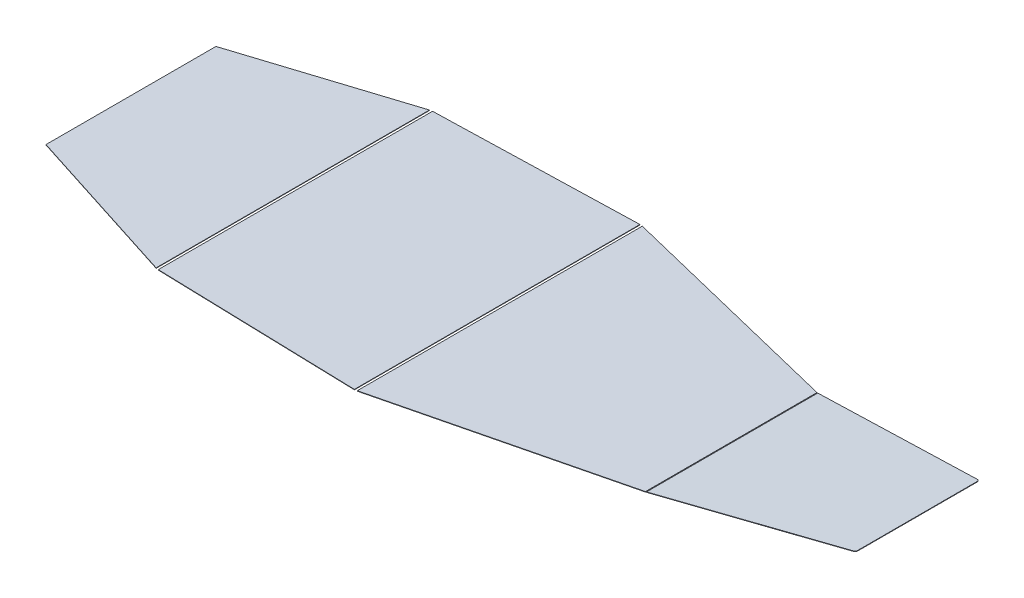
ISO-10303-21;
HEADER;
FILE_DESCRIPTION(('STEP AP214'),'2;1');
FILE_NAME('part.step','',(''),(''),'','','');
FILE_SCHEMA(('AUTOMOTIVE_DESIGN { 1 0 10303 214 1 1 1 1 }'));
ENDSEC;
DATA;
#1=APPLICATION_CONTEXT('core data for automotive mechanical design processes');
#2=APPLICATION_PROTOCOL_DEFINITION('international standard','automotive_design',2000,#1);
#3=PRODUCT_CONTEXT('',#1,'mechanical');
#4=PRODUCT('Part','Part','',(#3));
#5=PRODUCT_RELATED_PRODUCT_CATEGORY('part','',(#4));
#6=PRODUCT_DEFINITION_FORMATION('','',#4);
#7=PRODUCT_DEFINITION_CONTEXT('part definition',#1,'design');
#8=PRODUCT_DEFINITION('design','',#6,#7);
#9=PRODUCT_DEFINITION_SHAPE('','',#8);
#10=(LENGTH_UNIT() NAMED_UNIT(*) SI_UNIT(.MILLI.,.METRE.));
#11=(NAMED_UNIT(*) PLANE_ANGLE_UNIT() SI_UNIT($,.RADIAN.));
#12=(NAMED_UNIT(*) SI_UNIT($,.STERADIAN.) SOLID_ANGLE_UNIT());
#13=UNCERTAINTY_MEASURE_WITH_UNIT(LENGTH_MEASURE(1.E-05),#10,'distance_accuracy_value','');
#14=(GEOMETRIC_REPRESENTATION_CONTEXT(3) GLOBAL_UNCERTAINTY_ASSIGNED_CONTEXT((#13)) GLOBAL_UNIT_ASSIGNED_CONTEXT((#10,
#11,#12)) REPRESENTATION_CONTEXT('',''));
#15=CARTESIAN_POINT('',(0.,0.,0.));
#16=DIRECTION('',(0.,0.,1.));
#17=DIRECTION('',(1.,0.,0.));
#18=AXIS2_PLACEMENT_3D('',#15,#16,#17);
#19=CARTESIAN_POINT('',(2505.5741089449,126.22185605982,136.375901149343));
#20=DIRECTION('',(0.154776003065256,-0.987949588225606,0.));
#21=DIRECTION('',(0.987949588225606,0.154776003065257,0.));
#22=AXIS2_PLACEMENT_3D('',#19,#20,#21);
#23=CYLINDRICAL_SURFACE('',#22,5.99999999999981);
#24=CARTESIAN_POINT('',(2505.72888494797,125.233906471594,136.375901149343));
#25=DIRECTION('',(0.154776003065257,-0.987949588225606,0.));
#26=DIRECTION('',(0.987949588225606,0.154776003065257,0.));
#27=AXIS2_PLACEMENT_3D('',#24,#25,#26);
#28=CIRCLE('',#27,5.99999999999981);
#29=CARTESIAN_POINT('',(2511.65658247732,126.162562489986,136.375901149343));
#30=VERTEX_POINT('',#29);
#31=CARTESIAN_POINT('',(2506.47749497052,125.351186612734,142.327861196472));
#32=VERTEX_POINT('',#31);
#33=EDGE_CURVE('E130',#30,#32,#28,.T.);
#34=ORIENTED_EDGE('',*,*,#33,.F.);
#35=DIRECTION('',(0.154776003065256,-0.987949588225606,0.));
#36=VECTOR('',#35,1.);
#37=CARTESIAN_POINT('',(2511.50180647425,127.150512078212,136.375901149343));
#38=LINE('',#37,#36);
#39=CARTESIAN_POINT('',(2511.50180647425,127.150512078212,136.375901149343));
#40=VERTEX_POINT('',#39);
#41=EDGE_CURVE('E12',#40,#30,#38,.T.);
#42=ORIENTED_EDGE('',*,*,#41,.F.);
#43=CARTESIAN_POINT('',(2505.5741089449,126.22185605982,136.375901149343));
#44=DIRECTION('',(0.154776003065257,-0.987949588225606,0.));
#45=DIRECTION('',(0.987949588225606,0.154776003065257,0.));
#46=AXIS2_PLACEMENT_3D('',#43,#44,#45);
#47=CIRCLE('',#46,5.99999999999981);
#48=CARTESIAN_POINT('',(2506.32271896746,126.33913620096,142.327861196472));
#49=VERTEX_POINT('',#48);
#50=EDGE_CURVE('E142',#40,#49,#47,.T.);
#51=ORIENTED_EDGE('',*,*,#50,.T.);
#52=DIRECTION('',(0.154776003065256,-0.987949588225606,0.));
#53=VECTOR('',#52,1.);
#54=CARTESIAN_POINT('',(2506.32271896746,126.33913620096,142.327861196472));
#55=LINE('',#54,#53);
#56=EDGE_CURVE('E48',#49,#32,#55,.T.);
#57=ORIENTED_EDGE('',*,*,#56,.T.);
#58=EDGE_LOOP('',(#34,#42,#51,#57));
#59=FACE_BOUND('',#58,.T.);
#60=ADVANCED_FACE('F45',(#59),#23,.T.);
#61=CARTESIAN_POINT('',(2511.50180647425,127.150512078212,136.375901149343));
#62=DIRECTION('',(0.987949588225606,0.154776003065257,0.));
#63=DIRECTION('',(-0.154776003065257,0.987949588225606,0.));
#64=AXIS2_PLACEMENT_3D('',#61,#62,#63);
#65=PLANE('',#64);
#66=DIRECTION('',(0.,0.,1.));
#67=VECTOR('',#66,1.);
#68=CARTESIAN_POINT('',(2511.65658247732,126.162562489986,136.375901149343));
#69=LINE('',#68,#67);
#70=CARTESIAN_POINT('',(2511.65658247732,126.162562489986,-136.375901149342));
#71=VERTEX_POINT('',#70);
#72=EDGE_CURVE('E82',#71,#30,#69,.T.);
#73=ORIENTED_EDGE('',*,*,#72,.F.);
#74=DIRECTION('',(0.154776003065256,-0.987949588225606,0.));
#75=VECTOR('',#74,1.);
#76=CARTESIAN_POINT('',(2511.50180647425,127.150512078211,-136.375901149342));
#77=LINE('',#76,#75);
#78=CARTESIAN_POINT('',(2511.50180647425,127.150512078211,-136.375901149342));
#79=VERTEX_POINT('',#78);
#80=EDGE_CURVE('E54',#79,#71,#77,.T.);
#81=ORIENTED_EDGE('',*,*,#80,.F.);
#82=DIRECTION('',(0.,0.,1.));
#83=VECTOR('',#82,1.);
#84=CARTESIAN_POINT('',(2511.50180647425,127.150512078211,-136.375901149342));
#85=LINE('',#84,#83);
#86=EDGE_CURVE('E62',#79,#40,#85,.T.);
#87=ORIENTED_EDGE('',*,*,#86,.T.);
#88=ORIENTED_EDGE('',*,*,#41,.T.);
#89=EDGE_LOOP('',(#73,#81,#87,#88));
#90=FACE_BOUND('',#89,.T.);
#91=ADVANCED_FACE('F163',(#90),#65,.T.);
#92=CARTESIAN_POINT('',(2505.5741089449,126.22185605982,-136.375901149342));
#93=DIRECTION('',(0.154776003065256,-0.987949588225606,0.));
#94=DIRECTION('',(0.987949588225606,0.154776003065257,0.));
#95=AXIS2_PLACEMENT_3D('',#92,#93,#94);
#96=CYLINDRICAL_SURFACE('',#95,5.99999999999981);
#97=CARTESIAN_POINT('',(2505.72888494797,125.233906471594,-136.375901149342));
#98=DIRECTION('',(0.154776003065257,-0.987949588225606,0.));
#99=DIRECTION('',(-0.987949588225606,-0.154776003065257,0.));
#100=AXIS2_PLACEMENT_3D('',#97,#98,#99);
#101=CIRCLE('',#100,5.99999999999981);
#102=CARTESIAN_POINT('',(2506.47749497052,125.351186612734,-142.327861196472));
#103=VERTEX_POINT('',#102);
#104=EDGE_CURVE('E107',#103,#71,#101,.T.);
#105=ORIENTED_EDGE('',*,*,#104,.F.);
#106=DIRECTION('',(0.154776003065256,-0.987949588225606,0.));
#107=VECTOR('',#106,1.);
#108=CARTESIAN_POINT('',(2506.32271896746,126.339136200959,-142.327861196472));
#109=LINE('',#108,#107);
#110=CARTESIAN_POINT('',(2506.32271896746,126.339136200959,-142.327861196472));
#111=VERTEX_POINT('',#110);
#112=EDGE_CURVE('E102',#111,#103,#109,.T.);
#113=ORIENTED_EDGE('',*,*,#112,.F.);
#114=CARTESIAN_POINT('',(2505.5741089449,126.22185605982,-136.375901149342));
#115=DIRECTION('',(0.154776003065257,-0.987949588225606,0.));
#116=DIRECTION('',(-0.987949588225606,-0.154776003065257,0.));
#117=AXIS2_PLACEMENT_3D('',#114,#115,#116);
#118=CIRCLE('',#117,5.99999999999981);
#119=EDGE_CURVE('E105',#111,#79,#118,.T.);
#120=ORIENTED_EDGE('',*,*,#119,.T.);
#121=ORIENTED_EDGE('',*,*,#80,.T.);
#122=EDGE_LOOP('',(#105,#113,#120,#121));
#123=FACE_BOUND('',#122,.T.);
#124=ADVANCED_FACE('F104',(#123),#96,.T.);
#125=CARTESIAN_POINT('',(2086.12874483775,60.5099232502177,-196.475045869278));
#126=DIRECTION('',(0.124768337092657,0.0195466901899149,-0.991993341188212));
#127=DIRECTION('',(-0.992182902493873,0.,-0.124792179237461));
#128=AXIS2_PLACEMENT_3D('',#125,#126,#127);
#129=PLANE('',#128);
#130=DIRECTION('',(0.980039412949437,0.153536764416461,0.126290185835034));
#131=VECTOR('',#130,1.);
#132=CARTESIAN_POINT('',(2086.28352084082,59.5219736619921,-196.475045869278));
#133=LINE('',#132,#131);
#134=CARTESIAN_POINT('',(2086.28352084082,59.5219736619921,-196.475045869278));
#135=VERTEX_POINT('',#134);
#136=EDGE_CURVE('E139',#135,#103,#133,.T.);
#137=ORIENTED_EDGE('',*,*,#136,.F.);
#138=DIRECTION('',(0.154776003065256,-0.987949588225606,0.));
#139=VECTOR('',#138,1.);
#140=CARTESIAN_POINT('',(2086.12874483775,60.5099232502177,-196.475045869278));
#141=LINE('',#140,#139);
#142=CARTESIAN_POINT('',(2086.12874483775,60.5099232502177,-196.475045869278));
#143=VERTEX_POINT('',#142);
#144=EDGE_CURVE('E112',#143,#135,#141,.T.);
#145=ORIENTED_EDGE('',*,*,#144,.F.);
#146=DIRECTION('',(0.980039412949437,0.153536764416461,0.126290185835034));
#147=VECTOR('',#146,1.);
#148=CARTESIAN_POINT('',(2086.12874483775,60.5099232502177,-196.475045869278));
#149=LINE('',#148,#147);
#150=EDGE_CURVE('E119',#143,#111,#149,.T.);
#151=ORIENTED_EDGE('',*,*,#150,.T.);
#152=ORIENTED_EDGE('',*,*,#112,.T.);
#153=EDGE_LOOP('',(#137,#145,#151,#152));
#154=FACE_BOUND('',#153,.T.);
#155=ADVANCED_FACE('F122',(#154),#129,.T.);
#156=CARTESIAN_POINT('',(2086.12874483775,60.5099232502178,196.475045869278));
#157=DIRECTION('',(-0.987949588225606,-0.154776003065256,0.));
#158=DIRECTION('',(0.154776003065257,-0.987949588225606,0.));
#159=AXIS2_PLACEMENT_3D('',#156,#157,#158);
#160=PLANE('',#159);
#161=DIRECTION('',(0.,0.,-1.));
#162=VECTOR('',#161,1.);
#163=CARTESIAN_POINT('',(2086.28352084082,59.5219736619922,196.475045869278));
#164=LINE('',#163,#162);
#165=CARTESIAN_POINT('',(2086.28352084082,59.5219736619922,196.475045869278));
#166=VERTEX_POINT('',#165);
#167=EDGE_CURVE('E136',#166,#135,#164,.T.);
#168=ORIENTED_EDGE('',*,*,#167,.F.);
#169=DIRECTION('',(0.154776003065256,-0.987949588225606,0.));
#170=VECTOR('',#169,1.);
#171=CARTESIAN_POINT('',(2086.12874483775,60.5099232502178,196.475045869278));
#172=LINE('',#171,#170);
#173=CARTESIAN_POINT('',(2086.12874483775,60.5099232502178,196.475045869278));
#174=VERTEX_POINT('',#173);
#175=EDGE_CURVE('E145',#174,#166,#172,.T.);
#176=ORIENTED_EDGE('',*,*,#175,.F.);
#177=DIRECTION('',(0.,0.,-1.));
#178=VECTOR('',#177,1.);
#179=CARTESIAN_POINT('',(2086.12874483775,60.5099232502178,196.475045869278));
#180=LINE('',#179,#178);
#181=EDGE_CURVE('E123',#174,#143,#180,.T.);
#182=ORIENTED_EDGE('',*,*,#181,.T.);
#183=ORIENTED_EDGE('',*,*,#144,.T.);
#184=EDGE_LOOP('',(#168,#176,#182,#183));
#185=FACE_BOUND('',#184,.T.);
#186=ADVANCED_FACE('F153',(#185),#160,.T.);
#187=CARTESIAN_POINT('',(2086.12874483775,60.5099232502178,196.475045869278));
#188=DIRECTION('',(0.124768337092657,0.0195466901899152,0.991993341188212));
#189=DIRECTION('',(0.992182902493873,0.,-0.12479217923746));
#190=AXIS2_PLACEMENT_3D('',#187,#188,#189);
#191=PLANE('',#190);
#192=DIRECTION('',(-0.980039412949437,-0.153536764416461,0.126290185835034));
#193=VECTOR('',#192,1.);
#194=CARTESIAN_POINT('',(2086.28352084082,59.5219736619922,196.475045869278));
#195=LINE('',#194,#193);
#196=EDGE_CURVE('E133',#32,#166,#195,.T.);
#197=ORIENTED_EDGE('',*,*,#196,.F.);
#198=ORIENTED_EDGE('',*,*,#56,.F.);
#199=DIRECTION('',(-0.980039412949437,-0.153536764416461,0.126290185835034));
#200=VECTOR('',#199,1.);
#201=CARTESIAN_POINT('',(2086.12874483775,60.5099232502178,196.475045869278));
#202=LINE('',#201,#200);
#203=EDGE_CURVE('E125',#49,#174,#202,.T.);
#204=ORIENTED_EDGE('',*,*,#203,.T.);
#205=ORIENTED_EDGE('',*,*,#175,.T.);
#206=EDGE_LOOP('',(#197,#198,#204,#205));
#207=FACE_BOUND('',#206,.T.);
#208=ADVANCED_FACE('F149',(#207),#191,.T.);
#209=CARTESIAN_POINT('',(2505.5741089449,126.22185605982,136.375901149343));
#210=DIRECTION('',(0.154776003065257,-0.987949588225606,0.));
#211=DIRECTION('',(0.987949588225606,0.154776003065257,0.));
#212=AXIS2_PLACEMENT_3D('',#209,#210,#211);
#213=PLANE('',#212);
#214=ORIENTED_EDGE('',*,*,#50,.F.);
#215=ORIENTED_EDGE('',*,*,#86,.F.);
#216=ORIENTED_EDGE('',*,*,#119,.F.);
#217=ORIENTED_EDGE('',*,*,#150,.F.);
#218=ORIENTED_EDGE('',*,*,#181,.F.);
#219=ORIENTED_EDGE('',*,*,#203,.F.);
#220=EDGE_LOOP('',(#214,#215,#216,#217,#218,#219));
#221=FACE_BOUND('',#220,.T.);
#222=ADVANCED_FACE('F117',(#221),#213,.F.);
#223=CARTESIAN_POINT('',(2505.72888494797,125.233906471594,136.375901149343));
#224=DIRECTION('',(0.154776003065257,-0.987949588225606,0.));
#225=DIRECTION('',(0.987949588225606,0.154776003065257,0.));
#226=AXIS2_PLACEMENT_3D('',#223,#224,#225);
#227=PLANE('',#226);
#228=ORIENTED_EDGE('',*,*,#33,.T.);
#229=ORIENTED_EDGE('',*,*,#196,.T.);
#230=ORIENTED_EDGE('',*,*,#167,.T.);
#231=ORIENTED_EDGE('',*,*,#136,.T.);
#232=ORIENTED_EDGE('',*,*,#104,.T.);
#233=ORIENTED_EDGE('',*,*,#72,.T.);
#234=EDGE_LOOP('',(#228,#229,#230,#231,#232,#233));
#235=FACE_BOUND('',#234,.T.);
#236=ADVANCED_FACE('F151',(#235),#227,.T.);
#237=CLOSED_SHELL('',(#60,#91,#124,#155,#186,#208,#222,#236));
#238=MANIFOLD_SOLID_BREP('B2',#237);
#239=CARTESIAN_POINT('',(1083.5184979399,60.3,314.797366572685));
#240=DIRECTION('',(-0.0279961264300993,0.,0.999608031632855));
#241=DIRECTION('',(0.999608031632854,0.,0.0279961264300993));
#242=AXIS2_PLACEMENT_3D('',#239,#240,#241);
#243=PLANE('',#242);
#244=DIRECTION('',(-0.999608031632855,0.,-0.0279961264300993));
#245=VECTOR('',#244,1.);
#246=CARTESIAN_POINT('',(1083.5184979399,59.3,314.797366572685));
#247=LINE('',#246,#245);
#248=CARTESIAN_POINT('',(1546.67909351847,59.3,327.769153694159));
#249=VERTEX_POINT('',#248);
#250=CARTESIAN_POINT('',(1083.5184979399,59.3,314.797366572685));
#251=VERTEX_POINT('',#250);
#252=EDGE_CURVE('E300',#249,#251,#247,.T.);
#253=ORIENTED_EDGE('',*,*,#252,.F.);
#254=DIRECTION('',(0.,-1.,0.));
#255=VECTOR('',#254,1.);
#256=CARTESIAN_POINT('',(1546.67909351847,60.3,327.769153694159));
#257=LINE('',#256,#255);
#258=CARTESIAN_POINT('',(1546.67909351847,60.3,327.769153694159));
#259=VERTEX_POINT('',#258);
#260=EDGE_CURVE('E43',#259,#249,#257,.T.);
#261=ORIENTED_EDGE('',*,*,#260,.F.);
#262=DIRECTION('',(-0.999608031632855,0.,-0.0279961264300993));
#263=VECTOR('',#262,1.);
#264=CARTESIAN_POINT('',(1083.5184979399,60.3,314.797366572685));
#265=LINE('',#264,#263);
#266=CARTESIAN_POINT('',(1083.5184979399,60.3,314.797366572685));
#267=VERTEX_POINT('',#266);
#268=EDGE_CURVE('E294',#259,#267,#265,.T.);
#269=ORIENTED_EDGE('',*,*,#268,.T.);
#270=DIRECTION('',(0.,-1.,0.));
#271=VECTOR('',#270,1.);
#272=CARTESIAN_POINT('',(1083.5184979399,60.3,314.797366572685));
#273=LINE('',#272,#271);
#274=EDGE_CURVE('E239',#267,#251,#273,.T.);
#275=ORIENTED_EDGE('',*,*,#274,.T.);
#276=EDGE_LOOP('',(#253,#261,#269,#275));
#277=FACE_BOUND('',#276,.T.);
#278=ADVANCED_FACE('F236',(#277),#243,.T.);
#279=CARTESIAN_POINT('',(1546.67909351847,60.3,327.769153694159));
#280=DIRECTION('',(1.,0.,0.));
#281=DIRECTION('',(0.,0.,-1.));
#282=AXIS2_PLACEMENT_3D('',#279,#280,#281);
#283=PLANE('',#282);
#284=DIRECTION('',(0.,0.,1.));
#285=VECTOR('',#284,1.);
#286=CARTESIAN_POINT('',(1546.67909351847,59.3,327.769153694159));
#287=LINE('',#286,#285);
#288=CARTESIAN_POINT('',(1546.67909351847,59.3,-327.769153695261));
#289=VERTEX_POINT('',#288);
#290=EDGE_CURVE('E296',#289,#249,#287,.T.);
#291=ORIENTED_EDGE('',*,*,#290,.F.);
#292=DIRECTION('',(0.,-1.,0.));
#293=VECTOR('',#292,1.);
#294=CARTESIAN_POINT('',(1546.67909351847,60.3,-327.769153695261));
#295=LINE('',#294,#293);
#296=CARTESIAN_POINT('',(1546.67909351847,60.3,-327.769153695261));
#297=VERTEX_POINT('',#296);
#298=EDGE_CURVE('E245',#297,#289,#295,.T.);
#299=ORIENTED_EDGE('',*,*,#298,.F.);
#300=DIRECTION('',(0.,0.,1.));
#301=VECTOR('',#300,1.);
#302=CARTESIAN_POINT('',(1546.67909351847,60.3,327.769153694159));
#303=LINE('',#302,#301);
#304=EDGE_CURVE('E291',#297,#259,#303,.T.);
#305=ORIENTED_EDGE('',*,*,#304,.T.);
#306=ORIENTED_EDGE('',*,*,#260,.T.);
#307=EDGE_LOOP('',(#291,#299,#305,#306));
#308=FACE_BOUND('',#307,.T.);
#309=ADVANCED_FACE('F310',(#308),#283,.T.);
#310=CARTESIAN_POINT('',(1083.51849793991,60.3,-314.797366572692));
#311=DIRECTION('',(-0.0279961264324589,0.,-0.999608031632789));
#312=DIRECTION('',(-0.999608031632789,0.,0.0279961264324589));
#313=AXIS2_PLACEMENT_3D('',#310,#311,#312);
#314=PLANE('',#313);
#315=DIRECTION('',(0.999608031632788,0.,-0.0279961264324588));
#316=VECTOR('',#315,1.);
#317=CARTESIAN_POINT('',(1083.51849793991,59.3,-314.797366572692));
#318=LINE('',#317,#316);
#319=CARTESIAN_POINT('',(1083.51849793991,59.3,-314.797366572692));
#320=VERTEX_POINT('',#319);
#321=EDGE_CURVE('E286',#320,#289,#318,.T.);
#322=ORIENTED_EDGE('',*,*,#321,.F.);
#323=DIRECTION('',(0.,-1.,0.));
#324=VECTOR('',#323,1.);
#325=CARTESIAN_POINT('',(1083.51849793991,60.3,-314.797366572692));
#326=LINE('',#325,#324);
#327=CARTESIAN_POINT('',(1083.51849793991,60.3,-314.797366572692));
#328=VERTEX_POINT('',#327);
#329=EDGE_CURVE('E281',#328,#320,#326,.T.);
#330=ORIENTED_EDGE('',*,*,#329,.F.);
#331=DIRECTION('',(0.999608031632788,0.,-0.0279961264324588));
#332=VECTOR('',#331,1.);
#333=CARTESIAN_POINT('',(1083.51849793991,60.3,-314.797366572692));
#334=LINE('',#333,#332);
#335=EDGE_CURVE('E284',#328,#297,#334,.T.);
#336=ORIENTED_EDGE('',*,*,#335,.T.);
#337=ORIENTED_EDGE('',*,*,#298,.T.);
#338=EDGE_LOOP('',(#322,#330,#336,#337));
#339=FACE_BOUND('',#338,.T.);
#340=ADVANCED_FACE('F283',(#339),#314,.T.);
#341=CARTESIAN_POINT('',(1083.5184979399,60.3,314.797366572685));
#342=DIRECTION('',(-1.,0.,0.));
#343=DIRECTION('',(0.,0.,1.));
#344=AXIS2_PLACEMENT_3D('',#341,#342,#343);
#345=PLANE('',#344);
#346=DIRECTION('',(0.,0.,-1.));
#347=VECTOR('',#346,1.);
#348=CARTESIAN_POINT('',(1083.5184979399,59.3,314.797366572685));
#349=LINE('',#348,#347);
#350=EDGE_CURVE('E303',#251,#320,#349,.T.);
#351=ORIENTED_EDGE('',*,*,#350,.F.);
#352=ORIENTED_EDGE('',*,*,#274,.F.);
#353=DIRECTION('',(0.,0.,-1.));
#354=VECTOR('',#353,1.);
#355=CARTESIAN_POINT('',(1083.5184979399,60.3,314.797366572685));
#356=LINE('',#355,#354);
#357=EDGE_CURVE('E290',#267,#328,#356,.T.);
#358=ORIENTED_EDGE('',*,*,#357,.T.);
#359=ORIENTED_EDGE('',*,*,#329,.T.);
#360=EDGE_LOOP('',(#351,#352,#358,#359));
#361=FACE_BOUND('',#360,.T.);
#362=ADVANCED_FACE('F293',(#361),#345,.T.);
#363=CARTESIAN_POINT('',(0.,60.3,0.));
#364=DIRECTION('',(0.,1.,0.));
#365=DIRECTION('',(0.,0.,1.));
#366=AXIS2_PLACEMENT_3D('',#363,#364,#365);
#367=PLANE('',#366);
#368=ORIENTED_EDGE('',*,*,#268,.F.);
#369=ORIENTED_EDGE('',*,*,#304,.F.);
#370=ORIENTED_EDGE('',*,*,#335,.F.);
#371=ORIENTED_EDGE('',*,*,#357,.F.);
#372=EDGE_LOOP('',(#368,#369,#370,#371));
#373=FACE_BOUND('',#372,.T.);
#374=ADVANCED_FACE('F289',(#373),#367,.T.);
#375=CARTESIAN_POINT('',(0.,59.3,0.));
#376=DIRECTION('',(0.,1.,0.));
#377=DIRECTION('',(0.,0.,1.));
#378=AXIS2_PLACEMENT_3D('',#375,#376,#377);
#379=PLANE('',#378);
#380=ORIENTED_EDGE('',*,*,#252,.T.);
#381=ORIENTED_EDGE('',*,*,#350,.T.);
#382=ORIENTED_EDGE('',*,*,#321,.T.);
#383=ORIENTED_EDGE('',*,*,#290,.T.);
#384=EDGE_LOOP('',(#380,#381,#382,#383));
#385=FACE_BOUND('',#384,.T.);
#386=ADVANCED_FACE('F309',(#385),#379,.F.);
#387=CLOSED_SHELL('',(#278,#309,#340,#362,#374,#386));
#388=MANIFOLD_SOLID_BREP('B6',#387);
#389=CARTESIAN_POINT('',(706.,60.3,195.067870365376));
#390=DIRECTION('',(-0.304319977056343,0.,0.95256986702521));
#391=DIRECTION('',(0.95256986702521,0.,0.304319977056344));
#392=AXIS2_PLACEMENT_3D('',#389,#390,#391);
#393=PLANE('',#392);
#394=DIRECTION('',(-0.95256986702521,0.,-0.304319977056344));
#395=VECTOR('',#394,1.);
#396=CARTESIAN_POINT('',(706.,59.3,195.067870365376));
#397=LINE('',#396,#395);
#398=CARTESIAN_POINT('',(1077.51849793991,59.3,313.757852783313));
#399=VERTEX_POINT('',#398);
#400=CARTESIAN_POINT('',(706.,59.3,195.067870365376));
#401=VERTEX_POINT('',#400);
#402=EDGE_CURVE('E432',#399,#401,#397,.T.);
#403=ORIENTED_EDGE('',*,*,#402,.F.);
#404=DIRECTION('',(0.,-1.,0.));
#405=VECTOR('',#404,1.);
#406=CARTESIAN_POINT('',(1077.51849793991,60.3,313.757852783313));
#407=LINE('',#406,#405);
#408=CARTESIAN_POINT('',(1077.51849793991,60.3,313.757852783313));
#409=VERTEX_POINT('',#408);
#410=EDGE_CURVE('E234',#409,#399,#407,.T.);
#411=ORIENTED_EDGE('',*,*,#410,.F.);
#412=DIRECTION('',(-0.95256986702521,0.,-0.304319977056344));
#413=VECTOR('',#412,1.);
#414=CARTESIAN_POINT('',(706.,60.3,195.067870365376));
#415=LINE('',#414,#413);
#416=CARTESIAN_POINT('',(706.,60.3,195.067870365376));
#417=VERTEX_POINT('',#416);
#418=EDGE_CURVE('E426',#409,#417,#415,.T.);
#419=ORIENTED_EDGE('',*,*,#418,.T.);
#420=DIRECTION('',(0.,-1.,0.));
#421=VECTOR('',#420,1.);
#422=CARTESIAN_POINT('',(706.,60.3,195.067870365376));
#423=LINE('',#422,#421);
#424=EDGE_CURVE('E371',#417,#401,#423,.T.);
#425=ORIENTED_EDGE('',*,*,#424,.T.);
#426=EDGE_LOOP('',(#403,#411,#419,#425));
#427=FACE_BOUND('',#426,.T.);
#428=ADVANCED_FACE('F368',(#427),#393,.T.);
#429=CARTESIAN_POINT('',(1077.51849793991,60.3,313.757852783313));
#430=DIRECTION('',(1.,0.,0.));
#431=DIRECTION('',(0.,0.,-1.));
#432=AXIS2_PLACEMENT_3D('',#429,#430,#431);
#433=PLANE('',#432);
#434=DIRECTION('',(0.,0.,1.));
#435=VECTOR('',#434,1.);
#436=CARTESIAN_POINT('',(1077.51849793991,59.3,313.757852783313));
#437=LINE('',#436,#435);
#438=CARTESIAN_POINT('',(1077.51849793991,59.3,-313.757852783313));
#439=VERTEX_POINT('',#438);
#440=EDGE_CURVE('E428',#439,#399,#437,.T.);
#441=ORIENTED_EDGE('',*,*,#440,.F.);
#442=DIRECTION('',(0.,-1.,0.));
#443=VECTOR('',#442,1.);
#444=CARTESIAN_POINT('',(1077.51849793991,60.3,-313.757852783313));
#445=LINE('',#444,#443);
#446=CARTESIAN_POINT('',(1077.51849793991,60.3,-313.757852783313));
#447=VERTEX_POINT('',#446);
#448=EDGE_CURVE('E377',#447,#439,#445,.T.);
#449=ORIENTED_EDGE('',*,*,#448,.F.);
#450=DIRECTION('',(0.,0.,1.));
#451=VECTOR('',#450,1.);
#452=CARTESIAN_POINT('',(1077.51849793991,60.3,313.757852783313));
#453=LINE('',#452,#451);
#454=EDGE_CURVE('E423',#447,#409,#453,.T.);
#455=ORIENTED_EDGE('',*,*,#454,.T.);
#456=ORIENTED_EDGE('',*,*,#410,.T.);
#457=EDGE_LOOP('',(#441,#449,#455,#456));
#458=FACE_BOUND('',#457,.T.);
#459=ADVANCED_FACE('F442',(#458),#433,.T.);
#460=CARTESIAN_POINT('',(706.,60.3,-195.067870365376));
#461=DIRECTION('',(-0.304319977056344,0.,-0.95256986702521));
#462=DIRECTION('',(-0.95256986702521,0.,0.304319977056344));
#463=AXIS2_PLACEMENT_3D('',#460,#461,#462);
#464=PLANE('',#463);
#465=DIRECTION('',(0.95256986702521,0.,-0.304319977056344));
#466=VECTOR('',#465,1.);
#467=CARTESIAN_POINT('',(706.,59.3,-195.067870365376));
#468=LINE('',#467,#466);
#469=CARTESIAN_POINT('',(706.,59.3,-195.067870365376));
#470=VERTEX_POINT('',#469);
#471=EDGE_CURVE('E418',#470,#439,#468,.T.);
#472=ORIENTED_EDGE('',*,*,#471,.F.);
#473=DIRECTION('',(0.,-1.,0.));
#474=VECTOR('',#473,1.);
#475=CARTESIAN_POINT('',(706.,60.3,-195.067870365376));
#476=LINE('',#475,#474);
#477=CARTESIAN_POINT('',(706.,60.3,-195.067870365376));
#478=VERTEX_POINT('',#477);
#479=EDGE_CURVE('E413',#478,#470,#476,.T.);
#480=ORIENTED_EDGE('',*,*,#479,.F.);
#481=DIRECTION('',(0.95256986702521,0.,-0.304319977056344));
#482=VECTOR('',#481,1.);
#483=CARTESIAN_POINT('',(706.,60.3,-195.067870365376));
#484=LINE('',#483,#482);
#485=EDGE_CURVE('E416',#478,#447,#484,.T.);
#486=ORIENTED_EDGE('',*,*,#485,.T.);
#487=ORIENTED_EDGE('',*,*,#448,.T.);
#488=EDGE_LOOP('',(#472,#480,#486,#487));
#489=FACE_BOUND('',#488,.T.);
#490=ADVANCED_FACE('F415',(#489),#464,.T.);
#491=CARTESIAN_POINT('',(706.,60.3,-195.067870365376));
#492=DIRECTION('',(-1.,0.,0.));
#493=DIRECTION('',(0.,0.,1.));
#494=AXIS2_PLACEMENT_3D('',#491,#492,#493);
#495=PLANE('',#494);
#496=DIRECTION('',(0.,0.,-1.));
#497=VECTOR('',#496,1.);
#498=CARTESIAN_POINT('',(706.,59.3,-195.067870365376));
#499=LINE('',#498,#497);
#500=EDGE_CURVE('E435',#401,#470,#499,.T.);
#501=ORIENTED_EDGE('',*,*,#500,.F.);
#502=ORIENTED_EDGE('',*,*,#424,.F.);
#503=DIRECTION('',(0.,0.,-1.));
#504=VECTOR('',#503,1.);
#505=CARTESIAN_POINT('',(706.,60.3,-195.067870365376));
#506=LINE('',#505,#504);
#507=EDGE_CURVE('E422',#417,#478,#506,.T.);
#508=ORIENTED_EDGE('',*,*,#507,.T.);
#509=ORIENTED_EDGE('',*,*,#479,.T.);
#510=EDGE_LOOP('',(#501,#502,#508,#509));
#511=FACE_BOUND('',#510,.T.);
#512=ADVANCED_FACE('F425',(#511),#495,.T.);
#513=CARTESIAN_POINT('',(0.,60.3,0.));
#514=DIRECTION('',(0.,1.,0.));
#515=DIRECTION('',(0.,0.,1.));
#516=AXIS2_PLACEMENT_3D('',#513,#514,#515);
#517=PLANE('',#516);
#518=ORIENTED_EDGE('',*,*,#418,.F.);
#519=ORIENTED_EDGE('',*,*,#454,.F.);
#520=ORIENTED_EDGE('',*,*,#485,.F.);
#521=ORIENTED_EDGE('',*,*,#507,.F.);
#522=EDGE_LOOP('',(#518,#519,#520,#521));
#523=FACE_BOUND('',#522,.T.);
#524=ADVANCED_FACE('F421',(#523),#517,.T.);
#525=CARTESIAN_POINT('',(0.,59.3,0.));
#526=DIRECTION('',(0.,1.,0.));
#527=DIRECTION('',(0.,0.,1.));
#528=AXIS2_PLACEMENT_3D('',#525,#526,#527);
#529=PLANE('',#528);
#530=ORIENTED_EDGE('',*,*,#402,.T.);
#531=ORIENTED_EDGE('',*,*,#500,.T.);
#532=ORIENTED_EDGE('',*,*,#471,.T.);
#533=ORIENTED_EDGE('',*,*,#440,.T.);
#534=EDGE_LOOP('',(#530,#531,#532,#533));
#535=FACE_BOUND('',#534,.T.);
#536=ADVANCED_FACE('F441',(#535),#529,.F.);
#537=CLOSED_SHELL('',(#428,#459,#490,#512,#524,#536));
#538=MANIFOLD_SOLID_BREP('B37',#537);
#539=CARTESIAN_POINT('',(1552.67909351847,60.3,327.117712254985));
#540=DIRECTION('',(0.238103558655592,0.,0.971239772329955));
#541=DIRECTION('',(0.971239772329955,0.,-0.238103558655592));
#542=AXIS2_PLACEMENT_3D('',#539,#540,#541);
#543=PLANE('',#542);
#544=DIRECTION('',(-0.971239772329955,0.,0.238103558655592));
#545=VECTOR('',#544,1.);
#546=CARTESIAN_POINT('',(1552.67909351847,59.3,327.117712254985));
#547=LINE('',#546,#545);
#548=CARTESIAN_POINT('',(2084.05,59.3,196.849875821782));
#549=VERTEX_POINT('',#548);
#550=CARTESIAN_POINT('',(1552.67909351847,59.3,327.117712254985));
#551=VERTEX_POINT('',#550);
#552=EDGE_CURVE('E555',#549,#551,#547,.T.);
#553=ORIENTED_EDGE('',*,*,#552,.F.);
#554=DIRECTION('',(0.,-1.,0.));
#555=VECTOR('',#554,1.);
#556=CARTESIAN_POINT('',(2084.05,60.3,196.849875821782));
#557=LINE('',#556,#555);
#558=CARTESIAN_POINT('',(2084.05,60.3,196.849875821782));
#559=VERTEX_POINT('',#558);
#560=EDGE_CURVE('E366',#559,#549,#557,.T.);
#561=ORIENTED_EDGE('',*,*,#560,.F.);
#562=DIRECTION('',(-0.971239772329955,0.,0.238103558655592));
#563=VECTOR('',#562,1.);
#564=CARTESIAN_POINT('',(1552.67909351847,60.3,327.117712254985));
#565=LINE('',#564,#563);
#566=CARTESIAN_POINT('',(1552.67909351847,60.3,327.117712254985));
#567=VERTEX_POINT('',#566);
#568=EDGE_CURVE('E549',#559,#567,#565,.T.);
#569=ORIENTED_EDGE('',*,*,#568,.T.);
#570=DIRECTION('',(0.,-1.,0.));
#571=VECTOR('',#570,1.);
#572=CARTESIAN_POINT('',(1552.67909351847,60.3,327.117712254985));
#573=LINE('',#572,#571);
#574=EDGE_CURVE('E494',#567,#551,#573,.T.);
#575=ORIENTED_EDGE('',*,*,#574,.T.);
#576=EDGE_LOOP('',(#553,#561,#569,#575));
#577=FACE_BOUND('',#576,.T.);
#578=ADVANCED_FACE('F491',(#577),#543,.T.);
#579=CARTESIAN_POINT('',(2084.05,60.3,196.849875821782));
#580=DIRECTION('',(1.,0.,0.));
#581=DIRECTION('',(0.,0.,-1.));
#582=AXIS2_PLACEMENT_3D('',#579,#580,#581);
#583=PLANE('',#582);
#584=DIRECTION('',(0.,0.,1.));
#585=VECTOR('',#584,1.);
#586=CARTESIAN_POINT('',(2084.05,59.3,196.849875821782));
#587=LINE('',#586,#585);
#588=CARTESIAN_POINT('',(2084.05,59.3,-196.849875821782));
#589=VERTEX_POINT('',#588);
#590=EDGE_CURVE('E551',#589,#549,#587,.T.);
#591=ORIENTED_EDGE('',*,*,#590,.F.);
#592=DIRECTION('',(0.,-1.,0.));
#593=VECTOR('',#592,1.);
#594=CARTESIAN_POINT('',(2084.05,60.3,-196.849875821782));
#595=LINE('',#594,#593);
#596=CARTESIAN_POINT('',(2084.05,60.3,-196.849875821782));
#597=VERTEX_POINT('',#596);
#598=EDGE_CURVE('E500',#597,#589,#595,.T.);
#599=ORIENTED_EDGE('',*,*,#598,.F.);
#600=DIRECTION('',(0.,0.,1.));
#601=VECTOR('',#600,1.);
#602=CARTESIAN_POINT('',(2084.05,60.3,196.849875821782));
#603=LINE('',#602,#601);
#604=EDGE_CURVE('E546',#597,#559,#603,.T.);
#605=ORIENTED_EDGE('',*,*,#604,.T.);
#606=ORIENTED_EDGE('',*,*,#560,.T.);
#607=EDGE_LOOP('',(#591,#599,#605,#606));
#608=FACE_BOUND('',#607,.T.);
#609=ADVANCED_FACE('F565',(#608),#583,.T.);
#610=CARTESIAN_POINT('',(1552.67909351847,60.3,-327.117712254985));
#611=DIRECTION('',(0.238103558655592,0.,-0.971239772329955));
#612=DIRECTION('',(-0.971239772329955,0.,-0.238103558655592));
#613=AXIS2_PLACEMENT_3D('',#610,#611,#612);
#614=PLANE('',#613);
#615=DIRECTION('',(0.971239772329955,0.,0.238103558655592));
#616=VECTOR('',#615,1.);
#617=CARTESIAN_POINT('',(1552.67909351847,59.3,-327.117712254985));
#618=LINE('',#617,#616);
#619=CARTESIAN_POINT('',(1552.67909351847,59.3,-327.117712254985));
#620=VERTEX_POINT('',#619);
#621=EDGE_CURVE('E541',#620,#589,#618,.T.);
#622=ORIENTED_EDGE('',*,*,#621,.F.);
#623=DIRECTION('',(0.,-1.,0.));
#624=VECTOR('',#623,1.);
#625=CARTESIAN_POINT('',(1552.67909351847,60.3,-327.117712254985));
#626=LINE('',#625,#624);
#627=CARTESIAN_POINT('',(1552.67909351847,60.3,-327.117712254985));
#628=VERTEX_POINT('',#627);
#629=EDGE_CURVE('E536',#628,#620,#626,.T.);
#630=ORIENTED_EDGE('',*,*,#629,.F.);
#631=DIRECTION('',(0.971239772329955,0.,0.238103558655592));
#632=VECTOR('',#631,1.);
#633=CARTESIAN_POINT('',(1552.67909351847,60.3,-327.117712254985));
#634=LINE('',#633,#632);
#635=EDGE_CURVE('E539',#628,#597,#634,.T.);
#636=ORIENTED_EDGE('',*,*,#635,.T.);
#637=ORIENTED_EDGE('',*,*,#598,.T.);
#638=EDGE_LOOP('',(#622,#630,#636,#637));
#639=FACE_BOUND('',#638,.T.);
#640=ADVANCED_FACE('F538',(#639),#614,.T.);
#641=CARTESIAN_POINT('',(1552.67909351847,60.3,327.117712254985));
#642=DIRECTION('',(-1.,0.,0.));
#643=DIRECTION('',(0.,0.,1.));
#644=AXIS2_PLACEMENT_3D('',#641,#642,#643);
#645=PLANE('',#644);
#646=DIRECTION('',(0.,0.,-1.));
#647=VECTOR('',#646,1.);
#648=CARTESIAN_POINT('',(1552.67909351847,59.3,327.117712254985));
#649=LINE('',#648,#647);
#650=EDGE_CURVE('E558',#551,#620,#649,.T.);
#651=ORIENTED_EDGE('',*,*,#650,.F.);
#652=ORIENTED_EDGE('',*,*,#574,.F.);
#653=DIRECTION('',(0.,0.,-1.));
#654=VECTOR('',#653,1.);
#655=CARTESIAN_POINT('',(1552.67909351847,60.3,327.117712254985));
#656=LINE('',#655,#654);
#657=EDGE_CURVE('E545',#567,#628,#656,.T.);
#658=ORIENTED_EDGE('',*,*,#657,.T.);
#659=ORIENTED_EDGE('',*,*,#629,.T.);
#660=EDGE_LOOP('',(#651,#652,#658,#659));
#661=FACE_BOUND('',#660,.T.);
#662=ADVANCED_FACE('F548',(#661),#645,.T.);
#663=CARTESIAN_POINT('',(0.,60.3,0.));
#664=DIRECTION('',(0.,1.,0.));
#665=DIRECTION('',(0.,0.,1.));
#666=AXIS2_PLACEMENT_3D('',#663,#664,#665);
#667=PLANE('',#666);
#668=ORIENTED_EDGE('',*,*,#568,.F.);
#669=ORIENTED_EDGE('',*,*,#604,.F.);
#670=ORIENTED_EDGE('',*,*,#635,.F.);
#671=ORIENTED_EDGE('',*,*,#657,.F.);
#672=EDGE_LOOP('',(#668,#669,#670,#671));
#673=FACE_BOUND('',#672,.T.);
#674=ADVANCED_FACE('F544',(#673),#667,.T.);
#675=CARTESIAN_POINT('',(0.,59.3,0.));
#676=DIRECTION('',(0.,1.,0.));
#677=DIRECTION('',(0.,0.,1.));
#678=AXIS2_PLACEMENT_3D('',#675,#676,#677);
#679=PLANE('',#678);
#680=ORIENTED_EDGE('',*,*,#552,.T.);
#681=ORIENTED_EDGE('',*,*,#650,.T.);
#682=ORIENTED_EDGE('',*,*,#621,.T.);
#683=ORIENTED_EDGE('',*,*,#590,.T.);
#684=EDGE_LOOP('',(#680,#681,#682,#683));
#685=FACE_BOUND('',#684,.T.);
#686=ADVANCED_FACE('F564',(#685),#679,.F.);
#687=CLOSED_SHELL('',(#578,#609,#640,#662,#674,#686));
#688=MANIFOLD_SOLID_BREP('B228',#687);
#689=ADVANCED_BREP_SHAPE_REPRESENTATION('',(#18,#238,#388,#538,#688),#14);
#690=SHAPE_DEFINITION_REPRESENTATION(#9,#689);
ENDSEC;
END-ISO-10303-21;
